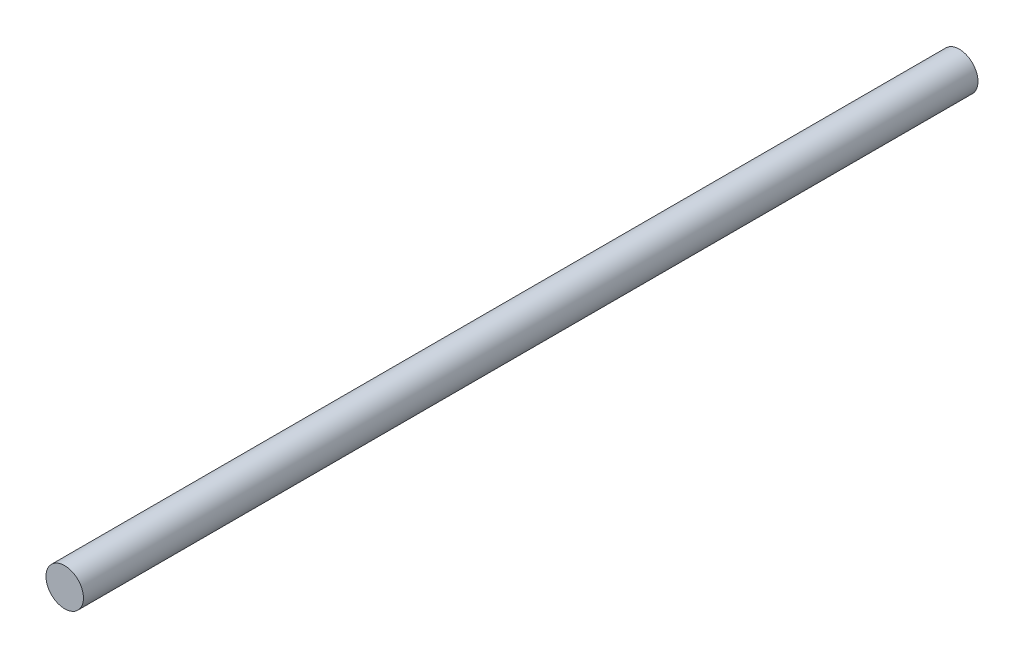
ISO-10303-21;
HEADER;
FILE_DESCRIPTION(('STEP AP214'),'2;1');
FILE_NAME('part.step','',(''),(''),'','','');
FILE_SCHEMA(('AUTOMOTIVE_DESIGN { 1 0 10303 214 1 1 1 1 }'));
ENDSEC;
DATA;
#1=APPLICATION_CONTEXT('core data for automotive mechanical design processes');
#2=APPLICATION_PROTOCOL_DEFINITION('international standard','automotive_design',2000,#1);
#3=PRODUCT_CONTEXT('',#1,'mechanical');
#4=PRODUCT('Part','Part','',(#3));
#5=PRODUCT_RELATED_PRODUCT_CATEGORY('part','',(#4));
#6=PRODUCT_DEFINITION_FORMATION('','',#4);
#7=PRODUCT_DEFINITION_CONTEXT('part definition',#1,'design');
#8=PRODUCT_DEFINITION('design','',#6,#7);
#9=PRODUCT_DEFINITION_SHAPE('','',#8);
#10=(LENGTH_UNIT() NAMED_UNIT(*) SI_UNIT(.MILLI.,.METRE.));
#11=(NAMED_UNIT(*) PLANE_ANGLE_UNIT() SI_UNIT($,.RADIAN.));
#12=(NAMED_UNIT(*) SI_UNIT($,.STERADIAN.) SOLID_ANGLE_UNIT());
#13=UNCERTAINTY_MEASURE_WITH_UNIT(LENGTH_MEASURE(1.E-05),#10,'distance_accuracy_value','');
#14=(GEOMETRIC_REPRESENTATION_CONTEXT(3) GLOBAL_UNCERTAINTY_ASSIGNED_CONTEXT((#13)) GLOBAL_UNIT_ASSIGNED_CONTEXT((#10,
#11,#12)) REPRESENTATION_CONTEXT('',''));
#15=CARTESIAN_POINT('',(0.,0.,0.));
#16=DIRECTION('',(0.,0.,1.));
#17=DIRECTION('',(1.,0.,0.));
#18=AXIS2_PLACEMENT_3D('',#15,#16,#17);
#19=CARTESIAN_POINT('',(0.,0.,191.));
#20=DIRECTION('',(0.,0.,-1.));
#21=DIRECTION('',(-1.,0.,0.));
#22=AXIS2_PLACEMENT_3D('',#19,#20,#21);
#23=CYLINDRICAL_SURFACE('',#22,8.);
#24=CARTESIAN_POINT('',(0.,0.,191.));
#25=DIRECTION('',(0.,0.,1.));
#26=DIRECTION('',(1.,0.,0.));
#27=AXIS2_PLACEMENT_3D('',#24,#25,#26);
#28=CIRCLE('',#27,8.);
#29=CARTESIAN_POINT('',(8.,0.,191.));
#30=VERTEX_POINT('',#29);
#31=EDGE_CURVE('E10',#30,#30,#28,.T.);
#32=ORIENTED_EDGE('',*,*,#31,.F.);
#33=EDGE_LOOP('',(#32));
#34=FACE_BOUND('',#33,.T.);
#35=CARTESIAN_POINT('',(0.,0.,-191.));
#36=DIRECTION('',(0.,0.,1.));
#37=DIRECTION('',(1.,0.,0.));
#38=AXIS2_PLACEMENT_3D('',#35,#36,#37);
#39=CIRCLE('',#38,8.);
#40=CARTESIAN_POINT('',(8.,0.,-191.));
#41=VERTEX_POINT('',#40);
#42=EDGE_CURVE('E33',#41,#41,#39,.T.);
#43=ORIENTED_EDGE('',*,*,#42,.T.);
#44=EDGE_LOOP('',(#43));
#45=FACE_BOUND('',#44,.T.);
#46=ADVANCED_FACE('F30',(#34,#45),#23,.T.);
#47=CARTESIAN_POINT('',(0.,0.,191.));
#48=DIRECTION('',(0.,0.,1.));
#49=DIRECTION('',(1.,0.,0.));
#50=AXIS2_PLACEMENT_3D('',#47,#48,#49);
#51=PLANE('',#50);
#52=ORIENTED_EDGE('',*,*,#31,.T.);
#53=EDGE_LOOP('',(#52));
#54=FACE_BOUND('',#53,.T.);
#55=ADVANCED_FACE('F45',(#54),#51,.T.);
#56=CARTESIAN_POINT('',(0.,0.,-191.));
#57=DIRECTION('',(0.,0.,1.));
#58=DIRECTION('',(1.,0.,0.));
#59=AXIS2_PLACEMENT_3D('',#56,#57,#58);
#60=PLANE('',#59);
#61=ORIENTED_EDGE('',*,*,#42,.F.);
#62=EDGE_LOOP('',(#61));
#63=FACE_BOUND('',#62,.T.);
#64=ADVANCED_FACE('F43',(#63),#60,.F.);
#65=CLOSED_SHELL('',(#46,#55,#64));
#66=MANIFOLD_SOLID_BREP('B2',#65);
#67=ADVANCED_BREP_SHAPE_REPRESENTATION('',(#18,#66),#14);
#68=SHAPE_DEFINITION_REPRESENTATION(#9,#67);
ENDSEC;
END-ISO-10303-21;
